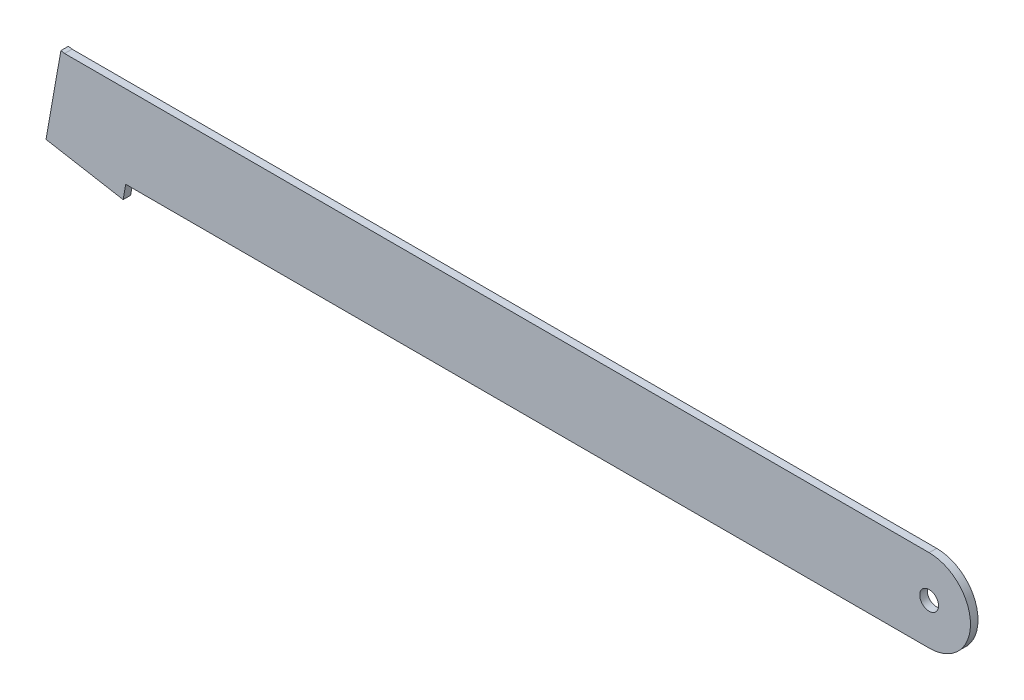
ISO-10303-21;
HEADER;
FILE_DESCRIPTION(('STEP AP214'),'2;1');
FILE_NAME('part.step','',(''),(''),'','','');
FILE_SCHEMA(('AUTOMOTIVE_DESIGN { 1 0 10303 214 1 1 1 1 }'));
ENDSEC;
DATA;
#1=APPLICATION_CONTEXT('core data for automotive mechanical design processes');
#2=APPLICATION_PROTOCOL_DEFINITION('international standard','automotive_design',2000,#1);
#3=PRODUCT_CONTEXT('',#1,'mechanical');
#4=PRODUCT('Part','Part','',(#3));
#5=PRODUCT_RELATED_PRODUCT_CATEGORY('part','',(#4));
#6=PRODUCT_DEFINITION_FORMATION('','',#4);
#7=PRODUCT_DEFINITION_CONTEXT('part definition',#1,'design');
#8=PRODUCT_DEFINITION('design','',#6,#7);
#9=PRODUCT_DEFINITION_SHAPE('','',#8);
#10=(LENGTH_UNIT() NAMED_UNIT(*) SI_UNIT(.MILLI.,.METRE.));
#11=(NAMED_UNIT(*) PLANE_ANGLE_UNIT() SI_UNIT($,.RADIAN.));
#12=(NAMED_UNIT(*) SI_UNIT($,.STERADIAN.) SOLID_ANGLE_UNIT());
#13=UNCERTAINTY_MEASURE_WITH_UNIT(LENGTH_MEASURE(1.E-05),#10,'distance_accuracy_value','');
#14=(GEOMETRIC_REPRESENTATION_CONTEXT(3) GLOBAL_UNCERTAINTY_ASSIGNED_CONTEXT((#13)) GLOBAL_UNIT_ASSIGNED_CONTEXT((#10,
#11,#12)) REPRESENTATION_CONTEXT('',''));
#15=CARTESIAN_POINT('',(0.,0.,0.));
#16=DIRECTION('',(0.,0.,1.));
#17=DIRECTION('',(1.,0.,0.));
#18=AXIS2_PLACEMENT_3D('',#15,#16,#17);
#19=CARTESIAN_POINT('',(0.,8.23023068446949E-06,10.));
#20=DIRECTION('',(0.,0.,-1.));
#21=DIRECTION('',(-1.,0.,0.));
#22=AXIS2_PLACEMENT_3D('',#19,#20,#21);
#23=PLANE('',#22);
#24=CARTESIAN_POINT('',(0.,8.23023068446949E-06,10.));
#25=DIRECTION('',(0.,0.,1.));
#26=DIRECTION('',(-1.,0.,0.));
#27=AXIS2_PLACEMENT_3D('',#24,#25,#26);
#28=CIRCLE('',#27,110.000008230231);
#29=CARTESIAN_POINT('',(0.,-110.,10.));
#30=VERTEX_POINT('',#29);
#31=CARTESIAN_POINT('',(0.,110.000016460461,10.));
#32=VERTEX_POINT('',#31);
#33=EDGE_CURVE('E162',#30,#32,#28,.T.);
#34=ORIENTED_EDGE('',*,*,#33,.T.);
#35=DIRECTION('',(-1.,0.,0.));
#36=VECTOR('',#35,1.);
#37=CARTESIAN_POINT('',(0.,110.000016460461,10.));
#38=LINE('',#37,#36);
#39=CARTESIAN_POINT('',(-2300.,110.000016460461,10.));
#40=VERTEX_POINT('',#39);
#41=EDGE_CURVE('E103',#32,#40,#38,.T.);
#42=ORIENTED_EDGE('',*,*,#41,.T.);
#43=DIRECTION('',(-0.984807753012209,0.173648177666924,0.));
#44=VECTOR('',#43,1.);
#45=CARTESIAN_POINT('',(-2300.,110.000016460461,10.));
#46=LINE('',#45,#44);
#47=CARTESIAN_POINT('',(-2309.84807753012,111.73649823713,10.));
#48=VERTEX_POINT('',#47);
#49=EDGE_CURVE('E179',#40,#48,#46,.T.);
#50=ORIENTED_EDGE('',*,*,#49,.T.);
#51=DIRECTION('',(-0.173648177666925,-0.984807753012209,0.));
#52=VECTOR('',#51,1.);
#53=CARTESIAN_POINT('',(-2309.84807753012,111.73649823713,10.));
#54=LINE('',#53,#52);
#55=CARTESIAN_POINT('',(-2349.41902425686,-112.681492519291,10.));
#56=VERTEX_POINT('',#55);
#57=EDGE_CURVE('E119',#48,#56,#54,.T.);
#58=ORIENTED_EDGE('',*,*,#57,.T.);
#59=DIRECTION('',(0.984807753014672,-0.173648177652955,0.));
#60=VECTOR('',#59,1.);
#61=CARTESIAN_POINT('',(-2349.41902425686,-112.681492519291,10.));
#62=LINE('',#61,#60);
#63=CARTESIAN_POINT('',(-2144.25515210263,-148.857418643702,10.));
#64=VERTEX_POINT('',#63);
#65=EDGE_CURVE('E113',#56,#64,#62,.T.);
#66=ORIENTED_EDGE('',*,*,#65,.T.);
#67=DIRECTION('',(0.173648177666919,0.98480775301221,0.));
#68=VECTOR('',#67,1.);
#69=CARTESIAN_POINT('',(-2137.40354079506,-110.,10.));
#70=LINE('',#69,#68);
#71=CARTESIAN_POINT('',(-2137.40354079506,-110.,10.));
#72=VERTEX_POINT('',#71);
#73=EDGE_CURVE('E117',#64,#72,#70,.T.);
#74=ORIENTED_EDGE('',*,*,#73,.T.);
#75=DIRECTION('',(1.,0.,0.));
#76=VECTOR('',#75,1.);
#77=CARTESIAN_POINT('',(0.,-110.,10.));
#78=LINE('',#77,#76);
#79=EDGE_CURVE('E63',#72,#30,#78,.T.);
#80=ORIENTED_EDGE('',*,*,#79,.T.);
#81=EDGE_LOOP('',(#34,#42,#50,#58,#66,#74,#80));
#82=FACE_BOUND('',#81,.T.);
#83=CARTESIAN_POINT('',(0.,8.23023068446949E-06,10.));
#84=DIRECTION('',(0.,0.,1.));
#85=DIRECTION('',(1.,0.,0.));
#86=AXIS2_PLACEMENT_3D('',#83,#84,#85);
#87=CIRCLE('',#86,25.);
#88=CARTESIAN_POINT('',(25.,8.23023068446949E-06,10.));
#89=VERTEX_POINT('',#88);
#90=EDGE_CURVE('E146',#89,#89,#87,.T.);
#91=ORIENTED_EDGE('',*,*,#90,.F.);
#92=EDGE_LOOP('',(#91));
#93=FACE_BOUND('',#92,.T.);
#94=ADVANCED_FACE('F45',(#82,#93),#23,.F.);
#95=CARTESIAN_POINT('',(0.,8.23023068446949E-06,-10.));
#96=DIRECTION('',(0.,0.,-1.));
#97=DIRECTION('',(-1.,0.,0.));
#98=AXIS2_PLACEMENT_3D('',#95,#96,#97);
#99=PLANE('',#98);
#100=CARTESIAN_POINT('',(0.,8.23023068446949E-06,-10.));
#101=DIRECTION('',(0.,0.,1.));
#102=DIRECTION('',(-1.,0.,0.));
#103=AXIS2_PLACEMENT_3D('',#100,#101,#102);
#104=CIRCLE('',#103,110.000008230231);
#105=CARTESIAN_POINT('',(0.,-110.,-10.));
#106=VERTEX_POINT('',#105);
#107=CARTESIAN_POINT('',(0.,110.000016460461,-10.));
#108=VERTEX_POINT('',#107);
#109=EDGE_CURVE('E141',#106,#108,#104,.T.);
#110=ORIENTED_EDGE('',*,*,#109,.F.);
#111=DIRECTION('',(1.,0.,0.));
#112=VECTOR('',#111,1.);
#113=CARTESIAN_POINT('',(0.,-110.,-10.));
#114=LINE('',#113,#112);
#115=CARTESIAN_POINT('',(-2137.40354079506,-110.,-10.));
#116=VERTEX_POINT('',#115);
#117=EDGE_CURVE('E95',#116,#106,#114,.T.);
#118=ORIENTED_EDGE('',*,*,#117,.F.);
#119=DIRECTION('',(0.173648177666919,0.98480775301221,0.));
#120=VECTOR('',#119,1.);
#121=CARTESIAN_POINT('',(-2137.40354079506,-110.,-10.));
#122=LINE('',#121,#120);
#123=CARTESIAN_POINT('',(-2144.25515210263,-148.857418643702,-10.));
#124=VERTEX_POINT('',#123);
#125=EDGE_CURVE('E89',#124,#116,#122,.T.);
#126=ORIENTED_EDGE('',*,*,#125,.F.);
#127=DIRECTION('',(0.984807753014672,-0.173648177652955,0.));
#128=VECTOR('',#127,1.);
#129=CARTESIAN_POINT('',(-2349.41902425686,-112.681492519291,-10.));
#130=LINE('',#129,#128);
#131=CARTESIAN_POINT('',(-2349.41902425686,-112.681492519291,-10.));
#132=VERTEX_POINT('',#131);
#133=EDGE_CURVE('E128',#132,#124,#130,.T.);
#134=ORIENTED_EDGE('',*,*,#133,.F.);
#135=DIRECTION('',(-0.173648177666926,-0.984807753012209,0.));
#136=VECTOR('',#135,1.);
#137=CARTESIAN_POINT('',(-2344.20957892685,-83.1372599289248,-10.));
#138=LINE('',#137,#136);
#139=CARTESIAN_POINT('',(-2309.84807753012,111.73649823713,-10.));
#140=VERTEX_POINT('',#139);
#141=EDGE_CURVE('E153',#140,#132,#138,.T.);
#142=ORIENTED_EDGE('',*,*,#141,.F.);
#143=DIRECTION('',(-0.984807753012209,0.173648177666924,0.));
#144=VECTOR('',#143,1.);
#145=CARTESIAN_POINT('',(-2300.,110.000016460461,-10.));
#146=LINE('',#145,#144);
#147=CARTESIAN_POINT('',(-2300.,110.000016460461,-10.));
#148=VERTEX_POINT('',#147);
#149=EDGE_CURVE('E149',#148,#140,#146,.T.);
#150=ORIENTED_EDGE('',*,*,#149,.F.);
#151=DIRECTION('',(-1.,0.,0.));
#152=VECTOR('',#151,1.);
#153=CARTESIAN_POINT('',(0.,110.000016460461,-10.));
#154=LINE('',#153,#152);
#155=EDGE_CURVE('E145',#108,#148,#154,.T.);
#156=ORIENTED_EDGE('',*,*,#155,.F.);
#157=EDGE_LOOP('',(#110,#118,#126,#134,#142,#150,#156));
#158=FACE_BOUND('',#157,.T.);
#159=CARTESIAN_POINT('',(0.,8.23023068446949E-06,-10.));
#160=DIRECTION('',(0.,0.,1.));
#161=DIRECTION('',(1.,0.,0.));
#162=AXIS2_PLACEMENT_3D('',#159,#160,#161);
#163=CIRCLE('',#162,25.);
#164=CARTESIAN_POINT('',(25.,8.23023068446949E-06,-10.));
#165=VERTEX_POINT('',#164);
#166=EDGE_CURVE('E194',#165,#165,#163,.T.);
#167=ORIENTED_EDGE('',*,*,#166,.T.);
#168=EDGE_LOOP('',(#167));
#169=FACE_BOUND('',#168,.T.);
#170=ADVANCED_FACE('F182',(#158,#169),#99,.T.);
#171=CARTESIAN_POINT('',(0.,8.23023068446949E-06,10.));
#172=DIRECTION('',(0.,0.,-1.));
#173=DIRECTION('',(-1.,0.,0.));
#174=AXIS2_PLACEMENT_3D('',#171,#172,#173);
#175=CYLINDRICAL_SURFACE('',#174,110.000008230231);
#176=ORIENTED_EDGE('',*,*,#109,.T.);
#177=DIRECTION('',(0.,0.,-1.));
#178=VECTOR('',#177,1.);
#179=CARTESIAN_POINT('',(0.,110.000016460461,10.));
#180=LINE('',#179,#178);
#181=EDGE_CURVE('E11',#32,#108,#180,.T.);
#182=ORIENTED_EDGE('',*,*,#181,.F.);
#183=ORIENTED_EDGE('',*,*,#33,.F.);
#184=DIRECTION('',(0.,0.,-1.));
#185=VECTOR('',#184,1.);
#186=CARTESIAN_POINT('',(0.,-110.,10.));
#187=LINE('',#186,#185);
#188=EDGE_CURVE('E137',#30,#106,#187,.T.);
#189=ORIENTED_EDGE('',*,*,#188,.T.);
#190=EDGE_LOOP('',(#176,#182,#183,#189));
#191=FACE_BOUND('',#190,.T.);
#192=ADVANCED_FACE('F47',(#191),#175,.T.);
#193=CARTESIAN_POINT('',(0.,110.000016460461,10.));
#194=DIRECTION('',(0.,-1.,0.));
#195=DIRECTION('',(1.,0.,0.));
#196=AXIS2_PLACEMENT_3D('',#193,#194,#195);
#197=PLANE('',#196);
#198=ORIENTED_EDGE('',*,*,#155,.T.);
#199=DIRECTION('',(0.,0.,-1.));
#200=VECTOR('',#199,1.);
#201=CARTESIAN_POINT('',(-2300.,110.000016460461,10.));
#202=LINE('',#201,#200);
#203=EDGE_CURVE('E55',#40,#148,#202,.T.);
#204=ORIENTED_EDGE('',*,*,#203,.F.);
#205=ORIENTED_EDGE('',*,*,#41,.F.);
#206=ORIENTED_EDGE('',*,*,#181,.T.);
#207=EDGE_LOOP('',(#198,#204,#205,#206));
#208=FACE_BOUND('',#207,.T.);
#209=ADVANCED_FACE('F222',(#208),#197,.F.);
#210=CARTESIAN_POINT('',(-2300.,110.000016460461,10.));
#211=DIRECTION('',(-0.173648177666924,-0.984807753012209,0.));
#212=DIRECTION('',(0.984807753012209,-0.173648177666924,0.));
#213=AXIS2_PLACEMENT_3D('',#210,#211,#212);
#214=PLANE('',#213);
#215=ORIENTED_EDGE('',*,*,#149,.T.);
#216=DIRECTION('',(0.,0.,-1.));
#217=VECTOR('',#216,1.);
#218=CARTESIAN_POINT('',(-2309.84807753012,111.73649823713,10.));
#219=LINE('',#218,#217);
#220=EDGE_CURVE('E169',#48,#140,#219,.T.);
#221=ORIENTED_EDGE('',*,*,#220,.F.);
#222=ORIENTED_EDGE('',*,*,#49,.F.);
#223=ORIENTED_EDGE('',*,*,#203,.T.);
#224=EDGE_LOOP('',(#215,#221,#222,#223));
#225=FACE_BOUND('',#224,.T.);
#226=ADVANCED_FACE('F177',(#225),#214,.F.);
#227=CARTESIAN_POINT('',(-2344.20957892685,-83.1372599289248,10.));
#228=DIRECTION('',(0.984807753012209,-0.173648177666926,0.));
#229=DIRECTION('',(0.173648177666926,0.984807753012209,0.));
#230=AXIS2_PLACEMENT_3D('',#227,#228,#229);
#231=PLANE('',#230);
#232=ORIENTED_EDGE('',*,*,#141,.T.);
#233=DIRECTION('',(0.,0.,-1.));
#234=VECTOR('',#233,1.);
#235=CARTESIAN_POINT('',(-2349.41902425686,-112.681492519291,10.));
#236=LINE('',#235,#234);
#237=EDGE_CURVE('E130',#56,#132,#236,.T.);
#238=ORIENTED_EDGE('',*,*,#237,.F.);
#239=ORIENTED_EDGE('',*,*,#57,.F.);
#240=ORIENTED_EDGE('',*,*,#220,.T.);
#241=EDGE_LOOP('',(#232,#238,#239,#240));
#242=FACE_BOUND('',#241,.T.);
#243=ADVANCED_FACE('F185',(#242),#231,.F.);
#244=CARTESIAN_POINT('',(-2349.41902425686,-112.681492519291,10.));
#245=DIRECTION('',(0.173648177652955,0.984807753014672,0.));
#246=DIRECTION('',(-0.984807753014672,0.173648177652955,0.));
#247=AXIS2_PLACEMENT_3D('',#244,#245,#246);
#248=PLANE('',#247);
#249=ORIENTED_EDGE('',*,*,#133,.T.);
#250=DIRECTION('',(0.,0.,-1.));
#251=VECTOR('',#250,1.);
#252=CARTESIAN_POINT('',(-2144.25515210263,-148.857418643702,10.));
#253=LINE('',#252,#251);
#254=EDGE_CURVE('E125',#64,#124,#253,.T.);
#255=ORIENTED_EDGE('',*,*,#254,.F.);
#256=ORIENTED_EDGE('',*,*,#65,.F.);
#257=ORIENTED_EDGE('',*,*,#237,.T.);
#258=EDGE_LOOP('',(#249,#255,#256,#257));
#259=FACE_BOUND('',#258,.T.);
#260=ADVANCED_FACE('F126',(#259),#248,.F.);
#261=CARTESIAN_POINT('',(-2137.40354079506,-110.,10.));
#262=DIRECTION('',(-0.98480775301221,0.173648177666919,0.));
#263=DIRECTION('',(-0.173648177666919,-0.98480775301221,0.));
#264=AXIS2_PLACEMENT_3D('',#261,#262,#263);
#265=PLANE('',#264);
#266=ORIENTED_EDGE('',*,*,#125,.T.);
#267=DIRECTION('',(0.,0.,-1.));
#268=VECTOR('',#267,1.);
#269=CARTESIAN_POINT('',(-2137.40354079506,-110.,10.));
#270=LINE('',#269,#268);
#271=EDGE_CURVE('E131',#72,#116,#270,.T.);
#272=ORIENTED_EDGE('',*,*,#271,.F.);
#273=ORIENTED_EDGE('',*,*,#73,.F.);
#274=ORIENTED_EDGE('',*,*,#254,.T.);
#275=EDGE_LOOP('',(#266,#272,#273,#274));
#276=FACE_BOUND('',#275,.T.);
#277=ADVANCED_FACE('F133',(#276),#265,.F.);
#278=CARTESIAN_POINT('',(0.,-110.,10.));
#279=DIRECTION('',(0.,1.,0.));
#280=DIRECTION('',(-1.,0.,0.));
#281=AXIS2_PLACEMENT_3D('',#278,#279,#280);
#282=PLANE('',#281);
#283=ORIENTED_EDGE('',*,*,#117,.T.);
#284=ORIENTED_EDGE('',*,*,#188,.F.);
#285=ORIENTED_EDGE('',*,*,#79,.F.);
#286=ORIENTED_EDGE('',*,*,#271,.T.);
#287=EDGE_LOOP('',(#283,#284,#285,#286));
#288=FACE_BOUND('',#287,.T.);
#289=ADVANCED_FACE('F212',(#288),#282,.F.);
#290=CARTESIAN_POINT('',(0.,8.23023068446949E-06,10.));
#291=DIRECTION('',(0.,0.,-1.));
#292=DIRECTION('',(-1.,0.,0.));
#293=AXIS2_PLACEMENT_3D('',#290,#291,#292);
#294=CYLINDRICAL_SURFACE('',#293,25.);
#295=ORIENTED_EDGE('',*,*,#90,.T.);
#296=EDGE_LOOP('',(#295));
#297=FACE_BOUND('',#296,.T.);
#298=ORIENTED_EDGE('',*,*,#166,.F.);
#299=EDGE_LOOP('',(#298));
#300=FACE_BOUND('',#299,.T.);
#301=ADVANCED_FACE('F202',(#297,#300),#294,.F.);
#302=CLOSED_SHELL('',(#94,#170,#192,#209,#226,#243,#260,#277,#289,#301));
#303=MANIFOLD_SOLID_BREP('B2',#302);
#304=ADVANCED_BREP_SHAPE_REPRESENTATION('',(#18,#303),#14);
#305=SHAPE_DEFINITION_REPRESENTATION(#9,#304);
ENDSEC;
END-ISO-10303-21;
